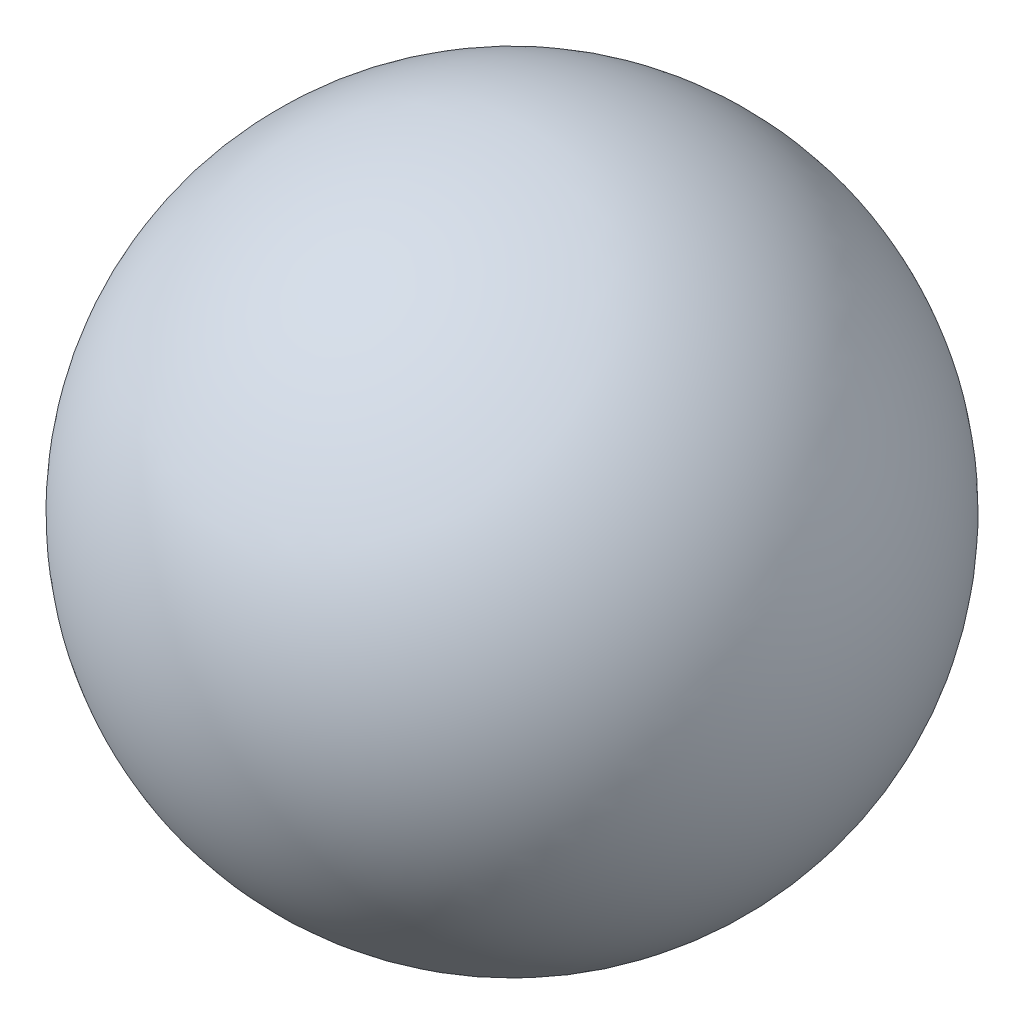
ISO-10303-21;
HEADER;
FILE_DESCRIPTION(('STEP AP214'),'2;1');
FILE_NAME('part.step','',(''),(''),'','','');
FILE_SCHEMA(('AUTOMOTIVE_DESIGN { 1 0 10303 214 1 1 1 1 }'));
ENDSEC;
DATA;
#1=APPLICATION_CONTEXT('core data for automotive mechanical design processes');
#2=APPLICATION_PROTOCOL_DEFINITION('international standard','automotive_design',2000,#1);
#3=PRODUCT_CONTEXT('',#1,'mechanical');
#4=PRODUCT('Part','Part','',(#3));
#5=PRODUCT_RELATED_PRODUCT_CATEGORY('part','',(#4));
#6=PRODUCT_DEFINITION_FORMATION('','',#4);
#7=PRODUCT_DEFINITION_CONTEXT('part definition',#1,'design');
#8=PRODUCT_DEFINITION('design','',#6,#7);
#9=PRODUCT_DEFINITION_SHAPE('','',#8);
#10=(LENGTH_UNIT() NAMED_UNIT(*) SI_UNIT(.MILLI.,.METRE.));
#11=(NAMED_UNIT(*) PLANE_ANGLE_UNIT() SI_UNIT($,.RADIAN.));
#12=(NAMED_UNIT(*) SI_UNIT($,.STERADIAN.) SOLID_ANGLE_UNIT());
#13=UNCERTAINTY_MEASURE_WITH_UNIT(LENGTH_MEASURE(1.E-05),#10,'distance_accuracy_value','');
#14=(GEOMETRIC_REPRESENTATION_CONTEXT(3) GLOBAL_UNCERTAINTY_ASSIGNED_CONTEXT((#13)) GLOBAL_UNIT_ASSIGNED_CONTEXT((#10,
#11,#12)) REPRESENTATION_CONTEXT('',''));
#15=CARTESIAN_POINT('',(0.,0.,0.));
#16=DIRECTION('',(0.,0.,1.));
#17=DIRECTION('',(1.,0.,0.));
#18=AXIS2_PLACEMENT_3D('',#15,#16,#17);
#19=CARTESIAN_POINT('',(-9.57126743659144,-2.,6.81566868746158));
#20=DIRECTION('',(0.,0.,1.));
#21=DIRECTION('',(1.,0.,0.));
#22=AXIS2_PLACEMENT_3D('',#19,#20,#21);
#23=SPHERICAL_SURFACE('',#22,1.05);
#24=CARTESIAN_POINT('',(-9.57126743659144,-2.,7.86566868746158));
#25=VERTEX_POINT('',#24);
#26=VERTEX_LOOP('',#25);
#27=FACE_BOUND('',#26,.T.);
#28=ADVANCED_FACE('F12',(#27),#23,.T.);
#29=CLOSED_SHELL('',(#28));
#30=MANIFOLD_SOLID_BREP('B1',#29);
#31=ADVANCED_BREP_SHAPE_REPRESENTATION('',(#18,#30),#14);
#32=SHAPE_DEFINITION_REPRESENTATION(#9,#31);
ENDSEC;
END-ISO-10303-21;
